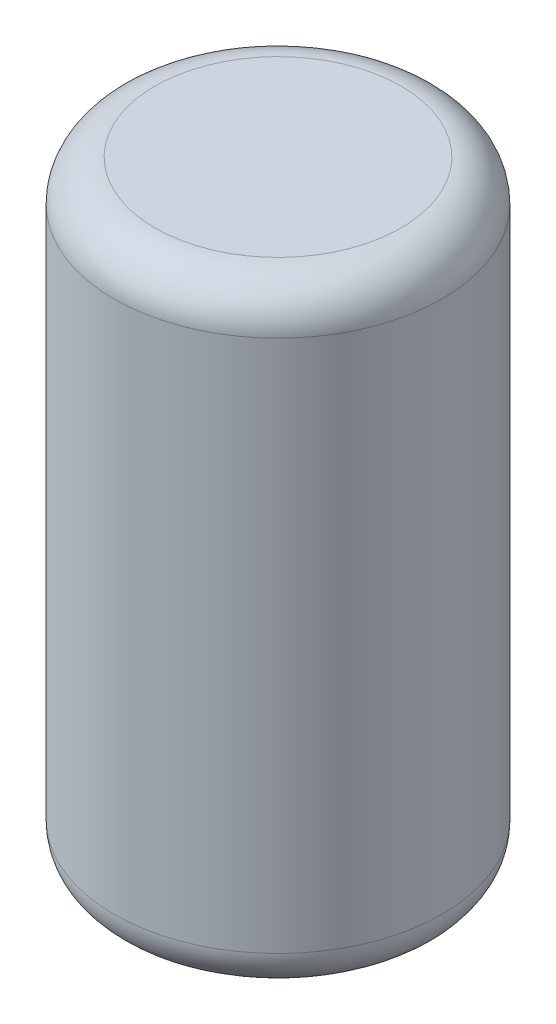
ISO-10303-21;
HEADER;
FILE_DESCRIPTION(('STEP AP214'),'2;1');
FILE_NAME('part.step','',(''),(''),'','','');
FILE_SCHEMA(('AUTOMOTIVE_DESIGN { 1 0 10303 214 1 1 1 1 }'));
ENDSEC;
DATA;
#1=APPLICATION_CONTEXT('core data for automotive mechanical design processes');
#2=APPLICATION_PROTOCOL_DEFINITION('international standard','automotive_design',2000,#1);
#3=PRODUCT_CONTEXT('',#1,'mechanical');
#4=PRODUCT('Part','Part','',(#3));
#5=PRODUCT_RELATED_PRODUCT_CATEGORY('part','',(#4));
#6=PRODUCT_DEFINITION_FORMATION('','',#4);
#7=PRODUCT_DEFINITION_CONTEXT('part definition',#1,'design');
#8=PRODUCT_DEFINITION('design','',#6,#7);
#9=PRODUCT_DEFINITION_SHAPE('','',#8);
#10=(LENGTH_UNIT() NAMED_UNIT(*) SI_UNIT(.MILLI.,.METRE.));
#11=(NAMED_UNIT(*) PLANE_ANGLE_UNIT() SI_UNIT($,.RADIAN.));
#12=(NAMED_UNIT(*) SI_UNIT($,.STERADIAN.) SOLID_ANGLE_UNIT());
#13=UNCERTAINTY_MEASURE_WITH_UNIT(LENGTH_MEASURE(1.E-05),#10,'distance_accuracy_value','');
#14=(GEOMETRIC_REPRESENTATION_CONTEXT(3) GLOBAL_UNCERTAINTY_ASSIGNED_CONTEXT((#13)) GLOBAL_UNIT_ASSIGNED_CONTEXT((#10,
#11,#12)) REPRESENTATION_CONTEXT('',''));
#15=CARTESIAN_POINT('',(0.,0.,0.));
#16=DIRECTION('',(0.,0.,1.));
#17=DIRECTION('',(1.,0.,0.));
#18=AXIS2_PLACEMENT_3D('',#15,#16,#17);
#19=CARTESIAN_POINT('',(0.,15.,0.));
#20=DIRECTION('',(0.,-1.,0.));
#21=DIRECTION('',(0.,0.,-1.));
#22=AXIS2_PLACEMENT_3D('',#19,#20,#21);
#23=CYLINDRICAL_SURFACE('',#22,4.);
#24=CARTESIAN_POINT('',(0.,1.,0.));
#25=DIRECTION('',(0.,1.,0.));
#26=DIRECTION('',(0.,0.,1.));
#27=AXIS2_PLACEMENT_3D('',#24,#25,#26);
#28=CIRCLE('',#27,4.);
#29=CARTESIAN_POINT('',(0.,1.,4.));
#30=VERTEX_POINT('',#29);
#31=EDGE_CURVE('E41',#30,#30,#28,.T.);
#32=ORIENTED_EDGE('',*,*,#31,.T.);
#33=EDGE_LOOP('',(#32));
#34=FACE_BOUND('',#33,.T.);
#35=CARTESIAN_POINT('',(0.,14.,0.));
#36=DIRECTION('',(0.,1.,0.));
#37=DIRECTION('',(0.,0.,1.));
#38=AXIS2_PLACEMENT_3D('',#35,#36,#37);
#39=CIRCLE('',#38,4.);
#40=CARTESIAN_POINT('',(0.,14.,4.));
#41=VERTEX_POINT('',#40);
#42=EDGE_CURVE('E45',#41,#41,#39,.F.);
#43=ORIENTED_EDGE('',*,*,#42,.T.);
#44=EDGE_LOOP('',(#43));
#45=FACE_BOUND('',#44,.T.);
#46=ADVANCED_FACE('F30',(#34,#45),#23,.T.);
#47=CARTESIAN_POINT('',(0.,15.,0.));
#48=DIRECTION('',(0.,1.,0.));
#49=DIRECTION('',(0.,0.,1.));
#50=AXIS2_PLACEMENT_3D('',#47,#48,#49);
#51=PLANE('',#50);
#52=CARTESIAN_POINT('',(0.,15.,0.));
#53=DIRECTION('',(0.,1.,0.));
#54=DIRECTION('',(0.,0.,1.));
#55=AXIS2_PLACEMENT_3D('',#52,#53,#54);
#56=CIRCLE('',#55,3.);
#57=CARTESIAN_POINT('',(0.,15.,3.));
#58=VERTEX_POINT('',#57);
#59=EDGE_CURVE('E10',#58,#58,#56,.T.);
#60=ORIENTED_EDGE('',*,*,#59,.T.);
#61=EDGE_LOOP('',(#60));
#62=FACE_BOUND('',#61,.T.);
#63=ADVANCED_FACE('F61',(#62),#51,.T.);
#64=CARTESIAN_POINT('',(0.,0.,0.));
#65=DIRECTION('',(0.,1.,0.));
#66=DIRECTION('',(0.,0.,1.));
#67=AXIS2_PLACEMENT_3D('',#64,#65,#66);
#68=PLANE('',#67);
#69=CARTESIAN_POINT('',(0.,0.,0.));
#70=DIRECTION('',(0.,1.,0.));
#71=DIRECTION('',(0.,0.,1.));
#72=AXIS2_PLACEMENT_3D('',#69,#70,#71);
#73=CIRCLE('',#72,3.);
#74=CARTESIAN_POINT('',(0.,0.,3.));
#75=VERTEX_POINT('',#74);
#76=EDGE_CURVE('E37',#75,#75,#73,.F.);
#77=ORIENTED_EDGE('',*,*,#76,.T.);
#78=EDGE_LOOP('',(#77));
#79=FACE_BOUND('',#78,.T.);
#80=ADVANCED_FACE('F58',(#79),#68,.F.);
#81=CARTESIAN_POINT('',(0.,1.,0.));
#82=DIRECTION('',(0.,1.,0.));
#83=DIRECTION('',(0.,0.,1.));
#84=AXIS2_PLACEMENT_3D('',#81,#82,#83);
#85=TOROIDAL_SURFACE('',#84,3.,1.);
#86=ORIENTED_EDGE('',*,*,#76,.F.);
#87=EDGE_LOOP('',(#86));
#88=FACE_BOUND('',#87,.T.);
#89=ORIENTED_EDGE('',*,*,#31,.F.);
#90=EDGE_LOOP('',(#89));
#91=FACE_BOUND('',#90,.T.);
#92=ADVANCED_FACE('F54',(#88,#91),#85,.T.);
#93=CARTESIAN_POINT('',(0.,14.,0.));
#94=DIRECTION('',(0.,1.,0.));
#95=DIRECTION('',(0.,0.,1.));
#96=AXIS2_PLACEMENT_3D('',#93,#94,#95);
#97=TOROIDAL_SURFACE('',#96,3.,1.);
#98=ORIENTED_EDGE('',*,*,#42,.F.);
#99=EDGE_LOOP('',(#98));
#100=FACE_BOUND('',#99,.T.);
#101=ORIENTED_EDGE('',*,*,#59,.F.);
#102=EDGE_LOOP('',(#101));
#103=FACE_BOUND('',#102,.T.);
#104=ADVANCED_FACE('F32',(#100,#103),#97,.T.);
#105=CLOSED_SHELL('',(#46,#63,#80,#92,#104));
#106=MANIFOLD_SOLID_BREP('B2',#105);
#107=ADVANCED_BREP_SHAPE_REPRESENTATION('',(#18,#106),#14);
#108=SHAPE_DEFINITION_REPRESENTATION(#9,#107);
ENDSEC;
END-ISO-10303-21;
